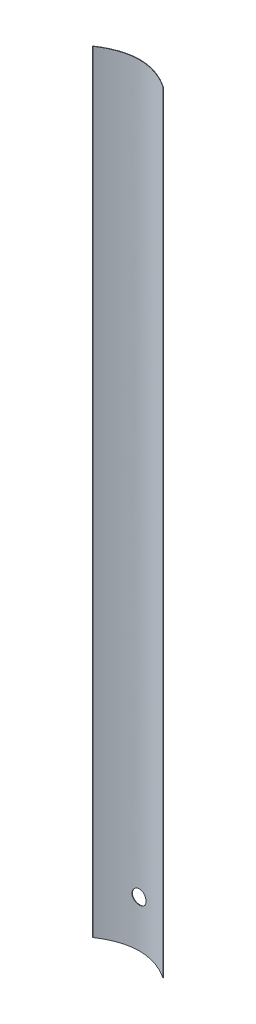
ISO-10303-21;
HEADER;
FILE_DESCRIPTION(('STEP AP214'),'2;1');
FILE_NAME('part.step','',(''),(''),'','','');
FILE_SCHEMA(('AUTOMOTIVE_DESIGN { 1 0 10303 214 1 1 1 1 }'));
ENDSEC;
DATA;
#1=APPLICATION_CONTEXT('core data for automotive mechanical design processes');
#2=APPLICATION_PROTOCOL_DEFINITION('international standard','automotive_design',2000,#1);
#3=PRODUCT_CONTEXT('',#1,'mechanical');
#4=PRODUCT('Part','Part','',(#3));
#5=PRODUCT_RELATED_PRODUCT_CATEGORY('part','',(#4));
#6=PRODUCT_DEFINITION_FORMATION('','',#4);
#7=PRODUCT_DEFINITION_CONTEXT('part definition',#1,'design');
#8=PRODUCT_DEFINITION('design','',#6,#7);
#9=PRODUCT_DEFINITION_SHAPE('','',#8);
#10=(LENGTH_UNIT() NAMED_UNIT(*) SI_UNIT(.MILLI.,.METRE.));
#11=(NAMED_UNIT(*) PLANE_ANGLE_UNIT() SI_UNIT($,.RADIAN.));
#12=(NAMED_UNIT(*) SI_UNIT($,.STERADIAN.) SOLID_ANGLE_UNIT());
#13=UNCERTAINTY_MEASURE_WITH_UNIT(LENGTH_MEASURE(1.E-05),#10,'distance_accuracy_value','');
#14=(GEOMETRIC_REPRESENTATION_CONTEXT(3) GLOBAL_UNCERTAINTY_ASSIGNED_CONTEXT((#13)) GLOBAL_UNIT_ASSIGNED_CONTEXT((#10,
#11,#12)) REPRESENTATION_CONTEXT('',''));
#15=CARTESIAN_POINT('',(0.,0.,0.));
#16=DIRECTION('',(0.,0.,1.));
#17=DIRECTION('',(1.,0.,0.));
#18=AXIS2_PLACEMENT_3D('',#15,#16,#17);
#19=CARTESIAN_POINT('',(7.55,165.1,2.55));
#20=CARTESIAN_POINT('',(0.,165.1,-2.55));
#21=CARTESIAN_POINT('',(-7.55,165.1,2.55));
#22=B_SPLINE_CURVE_WITH_KNOTS('',2,(#19,#20,#21),.UNSPECIFIED.,.F.,.F.,(3,3),(0.,1.),.UNSPECIFIED.);
#23=DIRECTION('',(0.,-1.,0.));
#24=VECTOR('',#23,1.);
#25=SURFACE_OF_LINEAR_EXTRUSION('',#22,#24);
#26=CARTESIAN_POINT('',(7.55,0.,2.55));
#27=CARTESIAN_POINT('',(0.,0.,-2.55));
#28=CARTESIAN_POINT('',(-7.55,0.,2.55));
#29=B_SPLINE_CURVE_WITH_KNOTS('',2,(#26,#27,#28),.UNSPECIFIED.,.F.,.F.,(3,3),(0.,1.),.UNSPECIFIED.);
#30=CARTESIAN_POINT('',(7.55,0.,2.55));
#31=VERTEX_POINT('',#30);
#32=CARTESIAN_POINT('',(-7.55,0.,2.55));
#33=VERTEX_POINT('',#32);
#34=EDGE_CURVE('E138',#31,#33,#29,.T.);
#35=ORIENTED_EDGE('',*,*,#34,.T.);
#36=DIRECTION('',(0.,-1.,0.));
#37=VECTOR('',#36,1.);
#38=CARTESIAN_POINT('',(-7.55,165.1,2.55));
#39=LINE('',#38,#37);
#40=CARTESIAN_POINT('',(-7.55,165.1,2.55));
#41=VERTEX_POINT('',#40);
#42=EDGE_CURVE('E11',#41,#33,#39,.T.);
#43=ORIENTED_EDGE('',*,*,#42,.F.);
#44=CARTESIAN_POINT('',(7.55,165.1,2.55));
#45=VERTEX_POINT('',#44);
#46=EDGE_CURVE('E99',#45,#41,#22,.T.);
#47=ORIENTED_EDGE('',*,*,#46,.F.);
#48=DIRECTION('',(0.,-1.,0.));
#49=VECTOR('',#48,1.);
#50=CARTESIAN_POINT('',(7.55,165.1,2.55));
#51=LINE('',#50,#49);
#52=EDGE_CURVE('E113',#45,#31,#51,.T.);
#53=ORIENTED_EDGE('',*,*,#52,.T.);
#54=EDGE_LOOP('',(#35,#43,#47,#53));
#55=FACE_BOUND('',#54,.T.);
#56=CARTESIAN_POINT('',(-1.5,10.,0.100653480110522));
#57=CARTESIAN_POINT('',(-1.49999431285718,10.0838646066992,0.100651792295512));
#58=CARTESIAN_POINT('',(-1.49293338316071,10.1678058005521,0.0996975639981939));
#59=CARTESIAN_POINT('',(-1.47193859508495,10.2918337185694,0.0969210509758727));
#60=CARTESIAN_POINT('',(-1.46319613678544,10.3328919671795,0.0957700049444247));
#61=CARTESIAN_POINT('',(-1.44230116384071,10.4141591924737,0.0930540127045029));
#62=CARTESIAN_POINT('',(-1.43014567901788,10.4543673964895,0.0914887060552477));
#63=CARTESIAN_POINT('',(-1.38872579838234,10.5731063897296,0.08623928605882));
#64=CARTESIAN_POINT('',(-1.35447729637129,10.6499314432978,0.0819973598487014));
#65=CARTESIAN_POINT('',(-1.27366670264574,10.7967402957515,0.0724976995606783));
#66=CARTESIAN_POINT('',(-1.22710371634554,10.8667235971118,0.0672398916915311));
#67=CARTESIAN_POINT('',(-1.14891722880494,10.9652814172152,0.0590199446646188));
#68=CARTESIAN_POINT('',(-1.1213562154828,10.9971622234563,0.0562142691923903));
#69=CARTESIAN_POINT('',(-1.0636836009766,11.058464445282,0.0505768141488451));
#70=CARTESIAN_POINT('',(-1.03357448605201,11.0878882038241,0.0477450623719434));
#71=CARTESIAN_POINT('',(-0.939660883994445,11.1722221739618,0.0393244827314267));
#72=CARTESIAN_POINT('',(-0.872251732421702,11.2232182370906,0.0338083132396485));
#73=CARTESIAN_POINT('',(-0.729552605881449,11.3133587939503,0.0235815519312012));
#74=CARTESIAN_POINT('',(-0.654233446146787,11.3524571646846,0.0188741252455889));
#75=CARTESIAN_POINT('',(-0.498015267740212,11.4174386640017,0.0108226125790484));
#76=CARTESIAN_POINT('',(-0.4171164883227,11.4433223588311,0.00747846818294234));
#77=CARTESIAN_POINT('',(-0.25255787469352,11.4809786661868,0.00255251178261552));
#78=CARTESIAN_POINT('',(-0.168917403810914,11.4928345864933,0.000960299447560821));
#79=CARTESIAN_POINT('',(-0.000819346726634837,11.5023598037955,-0.000315880879955819));
#80=CARTESIAN_POINT('',(0.0836382023600997,11.5000297421819,6.48540229111765E-08));
#81=CARTESIAN_POINT('',(0.250397215140917,11.4813156965399,0.00249568094463912));
#82=CARTESIAN_POINT('',(0.332709077696294,11.4650225332826,0.0046633070496314));
#83=CARTESIAN_POINT('',(0.493419855018071,11.4189869997377,0.0106022250034522));
#84=CARTESIAN_POINT('',(0.571818682946789,11.3892443311273,0.0143735524237988));
#85=CARTESIAN_POINT('',(0.72275755061085,11.3170580252888,0.0231126560570174));
#86=CARTESIAN_POINT('',(0.795278695384054,11.2745753417102,0.0280841011924957));
#87=CARTESIAN_POINT('',(0.932196985464237,11.1781431036395,0.0386641920627093));
#88=CARTESIAN_POINT('',(0.996593705047333,11.1241929486434,0.0442728711595746));
#89=CARTESIAN_POINT('',(1.11596568297943,11.0058524165738,0.0555509296080284));
#90=CARTESIAN_POINT('',(1.17086292806394,10.9413833287605,0.0612204396085769));
#91=CARTESIAN_POINT('',(1.2690697307717,10.8041047463486,0.0719390007951321));
#92=CARTESIAN_POINT('',(1.31237924946204,10.7312952237286,0.0769880498964584));
#93=CARTESIAN_POINT('',(1.38618506710864,10.5793346364595,0.0858972259978343));
#94=CARTESIAN_POINT('',(1.41667533332307,10.5001806068999,0.0897567929998749));
#95=CARTESIAN_POINT('',(1.46390914915503,10.3378128533396,0.0958430115563219));
#96=CARTESIAN_POINT('',(1.48065344861878,10.2545993510466,0.0980697521811431));
#97=CARTESIAN_POINT('',(1.49981680545721,10.0871571122116,0.100624757071384));
#98=CARTESIAN_POINT('',(1.50234457621831,10.0029410291904,0.100967428307808));
#99=CARTESIAN_POINT('',(1.49329052409646,9.83528645838535,0.0997541679389139));
#100=CARTESIAN_POINT('',(1.48170904539984,9.7518479516831,0.0981982826476949));
#101=CARTESIAN_POINT('',(1.44485629426366,9.5884434676593,0.0933740243452798));
#102=CARTESIAN_POINT('',(1.41963768567806,9.50846540174191,0.0901122407516485));
#103=CARTESIAN_POINT('',(1.35628123435544,9.35387289570522,0.0822451198699865));
#104=CARTESIAN_POINT('',(1.31814288536465,9.27925866590415,0.0776397299343732));
#105=CARTESIAN_POINT('',(1.22976671185468,9.13702515683216,0.0675661864530197));
#106=CARTESIAN_POINT('',(1.17945845465519,9.06944999760441,0.0620930770073404));
#107=CARTESIAN_POINT('',(1.06826960555367,8.94366335051936,0.0509135248451487));
#108=CARTESIAN_POINT('',(1.00738853669016,8.88545228532407,0.0452070716108969));
#109=CARTESIAN_POINT('',(0.876303853481724,8.77965943625974,0.0341592475910881));
#110=CARTESIAN_POINT('',(0.806041887715526,8.7321496389072,0.0288205077945384));
#111=CARTESIAN_POINT('',(0.65847167757806,8.64960667169101,0.0191531771295273));
#112=CARTESIAN_POINT('',(0.581163592612102,8.61457321966127,0.0148245634167305));
#113=CARTESIAN_POINT('',(0.421925924913392,8.55809385219361,0.0076812972517419));
#114=CARTESIAN_POINT('',(0.340010842989731,8.53660764588505,0.00486215927428902));
#115=CARTESIAN_POINT('',(0.173695875743016,8.50770201052955,0.00104048718657157));
#116=CARTESIAN_POINT('',(0.0892961220181454,8.50028183784539,3.78570420480021E-05));
#117=CARTESIAN_POINT('',(-0.078886813317133,8.49973614514404,-3.54433868341092E-05));
#118=CARTESIAN_POINT('',(-0.162669626042992,8.50649870844328,0.000878760481065696));
#119=CARTESIAN_POINT('',(-0.327886757549376,8.53388063435902,0.00450386476565588));
#120=CARTESIAN_POINT('',(-0.409321078293532,8.55449998538919,0.00721476368004195));
#121=CARTESIAN_POINT('',(-0.567554820884802,8.60900332200392,0.0141301827811963));
#122=CARTESIAN_POINT('',(-0.644356382605339,8.64288112850882,0.0183340071083666));
#123=CARTESIAN_POINT('',(-0.754407562727833,8.7028410554571,0.0253992468835352));
#124=CARTESIAN_POINT('',(-0.790239610339055,8.72435694021079,0.0278815001190132));
#125=CARTESIAN_POINT('',(-0.86001175884085,8.77031465432354,0.0330324110184899));
#126=CARTESIAN_POINT('',(-0.893950012257326,8.79475927008633,0.0357012451747152));
#127=CARTESIAN_POINT('',(-0.992968618144739,8.87257675409185,0.0439125539480101));
#128=CARTESIAN_POINT('',(-1.05478391747525,8.93017751012652,0.0496283201585527));
#129=CARTESIAN_POINT('',(-1.16788382971883,9.05494083439578,0.0608724682506412));
#130=CARTESIAN_POINT('',(-1.21916854692724,9.12210330791955,0.0664008519875784));
#131=CARTESIAN_POINT('',(-1.28721561200791,9.22872097494616,0.0740991601405075));
#132=CARTESIAN_POINT('',(-1.3084665396122,9.26535398220838,0.0765725158407119));
#133=CARTESIAN_POINT('',(-1.34778787538475,9.34025995872086,0.0812451514542522));
#134=CARTESIAN_POINT('',(-1.36586109294731,9.37853144179429,0.0834446729553131));
#135=CARTESIAN_POINT('',(-1.41510379001963,9.49541474988402,0.0895334562633409));
#136=CARTESIAN_POINT('',(-1.44136654006385,9.57620563882681,0.0929211905107007));
#137=CARTESIAN_POINT('',(-1.47369923859358,9.71448535437408,0.0971475067702848));
#138=CARTESIAN_POINT('',(-1.48354597342427,9.7711204485693,0.0984554075553561));
#139=CARTESIAN_POINT('',(-1.49669827226383,9.88515839112116,0.100208968338332));
#140=CARTESIAN_POINT('',(-1.50000389511722,9.94256123256641,0.100654636092975));
#141=CARTESIAN_POINT('',(-1.5,10.,0.100653480110522));
#142=B_SPLINE_CURVE_WITH_KNOTS('',3,(#56,#57,#58,#59,#60,#61,#62,#63,#64,#65,#66,#67,#68,#69,
#70,#71,#72,#73,#74,#75,#76,#77,#78,#79,#80,#81,#82,#83,#84,#85,#86,#87,#88,#89,#90,#91,#92,#93,
#94,#95,#96,#97,#98,#99,#100,#101,#102,#103,#104,#105,#106,#107,#108,#109,#110,#111,#112,#113,
#114,#115,#116,#117,#118,#119,#120,#121,#122,#123,#124,#125,#126,#127,#128,#129,#130,#131,#132,
#133,#134,#135,#136,#137,#138,#139,#140,#141),.UNSPECIFIED.,.T.,.F.,(4,2,2,2,2,2,2,2,2,2,2,2,2,
2,2,2,2,2,2,2,2,2,2,2,2,2,2,2,2,2,2,2,2,2,2,2,2,2,2,2,2,2,4),(0.,0.251349590871803,
0.377210195403726,0.503180671101366,0.75458108650983,1.00599976992016,1.1325762592091,
1.25903063734846,1.51185156364136,1.76564045187467,2.01941846438412,2.27168165867217,
2.52393344746866,2.77455685039652,3.02518581266382,3.27659090724563,3.52800917011144,
3.78140315101232,4.03479798326584,4.28831193004449,4.54181204664934,4.79337099177385,
5.04492380039797,5.29551202881263,5.54611007754173,5.79819468739714,6.05029067226768,
6.30403494960028,6.5577734878659,6.81075377771051,7.06372069272501,7.31469894648494,
7.56567699038999,7.81653820544647,7.94202050411351,8.0676231494658,8.32041322945643,
8.57320080568258,8.7003337405797,8.82735370658069,9.08100572243983,9.25315630113189,
9.42530533113218),.UNSPECIFIED.);
#143=CARTESIAN_POINT('',(-1.5,10.,0.100653480110522));
#144=VERTEX_POINT('',#143);
#145=EDGE_CURVE('E141',#144,#144,#142,.T.);
#146=ORIENTED_EDGE('',*,*,#145,.F.);
#147=EDGE_LOOP('',(#146));
#148=FACE_BOUND('',#147,.T.);
#149=ADVANCED_FACE('F39',(#55,#148),#25,.F.);
#150=CARTESIAN_POINT('',(-7.45,165.1,2.55));
#151=CARTESIAN_POINT('',(0.,165.1,-2.35));
#152=CARTESIAN_POINT('',(7.45,165.1,2.55));
#153=B_SPLINE_CURVE_WITH_KNOTS('',2,(#150,#151,#152),.UNSPECIFIED.,.F.,.F.,(3,3),(0.,1.),.UNSPECIFIED.);
#154=DIRECTION('',(0.,-1.,0.));
#155=VECTOR('',#154,1.);
#156=SURFACE_OF_LINEAR_EXTRUSION('',#153,#155);
#157=CARTESIAN_POINT('',(-7.45,0.,2.55));
#158=CARTESIAN_POINT('',(0.,0.,-2.35));
#159=CARTESIAN_POINT('',(7.45,0.,2.55));
#160=B_SPLINE_CURVE_WITH_KNOTS('',2,(#157,#158,#159),.UNSPECIFIED.,.F.,.F.,(3,3),(0.,1.),.UNSPECIFIED.);
#161=CARTESIAN_POINT('',(-7.45,0.,2.55));
#162=VERTEX_POINT('',#161);
#163=CARTESIAN_POINT('',(7.45,0.,2.55));
#164=VERTEX_POINT('',#163);
#165=EDGE_CURVE('E81',#162,#164,#160,.T.);
#166=ORIENTED_EDGE('',*,*,#165,.T.);
#167=DIRECTION('',(0.,-1.,0.));
#168=VECTOR('',#167,1.);
#169=CARTESIAN_POINT('',(7.45,165.1,2.55));
#170=LINE('',#169,#168);
#171=CARTESIAN_POINT('',(7.45,165.1,2.55));
#172=VERTEX_POINT('',#171);
#173=EDGE_CURVE('E106',#172,#164,#170,.T.);
#174=ORIENTED_EDGE('',*,*,#173,.F.);
#175=CARTESIAN_POINT('',(-7.45,165.1,2.55));
#176=VERTEX_POINT('',#175);
#177=EDGE_CURVE('E97',#176,#172,#153,.T.);
#178=ORIENTED_EDGE('',*,*,#177,.F.);
#179=DIRECTION('',(0.,-1.,0.));
#180=VECTOR('',#179,1.);
#181=CARTESIAN_POINT('',(-7.45,165.1,2.55));
#182=LINE('',#181,#180);
#183=EDGE_CURVE('E56',#176,#162,#182,.T.);
#184=ORIENTED_EDGE('',*,*,#183,.T.);
#185=EDGE_LOOP('',(#166,#174,#178,#184));
#186=FACE_BOUND('',#185,.T.);
#187=CARTESIAN_POINT('',(-1.5,10.,0.199319850457186));
#188=CARTESIAN_POINT('',(-1.49999430848386,9.91612492163028,0.199318182227655));
#189=CARTESIAN_POINT('',(-1.49293162183111,9.83217296057274,0.198376362523933));
#190=CARTESIAN_POINT('',(-1.47193131908059,9.70812874572493,0.195635928665539));
#191=CARTESIAN_POINT('',(-1.46318650797823,9.66706494479353,0.194499833439166));
#192=CARTESIAN_POINT('',(-1.44228577972542,9.58578661984074,0.191819112214607));
#193=CARTESIAN_POINT('',(-1.43012689060928,9.5455728687333,0.190274130346939));
#194=CARTESIAN_POINT('',(-1.38869498973417,9.42681700663659,0.185092842792504));
#195=CARTESIAN_POINT('',(-1.35443613249865,9.34998082134359,0.180905948855757));
#196=CARTESIAN_POINT('',(-1.27360014927512,9.20315176876102,0.171529597235092));
#197=CARTESIAN_POINT('',(-1.22702214527932,9.13315938972905,0.166340068098665));
#198=CARTESIAN_POINT('',(-1.14881402064101,9.03459565960986,0.158227468412158));
#199=CARTESIAN_POINT('',(-1.12124817493762,9.00271620147691,0.155458738766124));
#200=CARTESIAN_POINT('',(-1.06356585942425,8.94141715985287,0.149895617312838));
#201=CARTESIAN_POINT('',(-1.03345187566475,8.9119952331648,0.147101252836312));
#202=CARTESIAN_POINT('',(-0.939523860548354,8.82766770109499,0.138792026417468));
#203=CARTESIAN_POINT('',(-0.872105321432624,8.77667714547239,0.133349037082873));
#204=CARTESIAN_POINT('',(-0.729396746150069,8.68655497139147,0.12325905828651));
#205=CARTESIAN_POINT('',(-0.654078320898569,8.64746824036854,0.118615109816103));
#206=CARTESIAN_POINT('',(-0.497865558488165,8.58250914254702,0.110672652109048));
#207=CARTESIAN_POINT('',(-0.416971454309424,8.55663622398773,0.107374086695262));
#208=CARTESIAN_POINT('',(-0.25241279356707,8.51899633098805,0.10251541176302));
#209=CARTESIAN_POINT('',(-0.16876708393661,8.50714820021797,0.100945304029303));
#210=CARTESIAN_POINT('',(-0.000660304636181675,8.49763989407351,0.0996882603813845));
#211=CARTESIAN_POINT('',(0.0838007289306916,8.49997909332578,0.100001241461174));
#212=CARTESIAN_POINT('',(0.250580012756493,8.51871418145095,0.102466531176089));
#213=CARTESIAN_POINT('',(0.332908394334284,8.53502162850044,0.104607266865084));
#214=CARTESIAN_POINT('',(0.493649835440898,8.58109184585235,0.11047166057192));
#215=CARTESIAN_POINT('',(0.572062810071875,8.61085490777257,0.1141953528964));
#216=CARTESIAN_POINT('',(0.72302026890586,8.68308524735493,0.122823143734849));
#217=CARTESIAN_POINT('',(0.795546316765941,8.72559061702758,0.127730772811627));
#218=CARTESIAN_POINT('',(0.932469595415847,8.82207151731782,0.138174326273406));
#219=CARTESIAN_POINT('',(0.99686641127381,8.87604763304765,0.143710282702095));
#220=CARTESIAN_POINT('',(1.11621982931086,8.99442966367382,0.154840018407951));
#221=CARTESIAN_POINT('',(1.17110042218408,9.0589122289115,0.160433915992556));
#222=CARTESIAN_POINT('',(1.26927146334274,9.19621383285374,0.171008510815199));
#223=CARTESIAN_POINT('',(1.31256187451126,9.26903289825441,0.175989206089462));
#224=CARTESIAN_POINT('',(1.38632713462777,9.42100598883487,0.184776566618406));
#225=CARTESIAN_POINT('',(1.41679620122249,9.5001628532118,0.188582701947364));
#226=CARTESIAN_POINT('',(1.46398812186988,9.66253094000489,0.194583370253541));
#227=CARTESIAN_POINT('',(1.48071170572754,9.7457419469212,0.196777988792245));
#228=CARTESIAN_POINT('',(1.49983758193486,9.91319158130336,0.199294273517368));
#229=CARTESIAN_POINT('',(1.50234577630529,9.99741791255856,0.199629789255558));
#230=CARTESIAN_POINT('',(1.49324953676709,10.1650896882237,0.198427042408363));
#231=CARTESIAN_POINT('',(1.48164543789711,10.2485351511248,0.196888824307118));
#232=CARTESIAN_POINT('',(1.44474267411651,10.4119591419536,0.192122310316789));
#233=CARTESIAN_POINT('',(1.41949522398304,10.4919494349244,0.188900336435752));
#234=CARTESIAN_POINT('',(1.35607558656885,10.6465612921507,0.181130685808157));
#235=CARTESIAN_POINT('',(1.3179029049684,10.7211826509413,0.176582958359669));
#236=CARTESIAN_POINT('',(1.22945986851615,10.8634129233087,0.16663752665366));
#237=CARTESIAN_POINT('',(1.17912082699192,10.9309787866973,0.161235058903362));
#238=CARTESIAN_POINT('',(1.06787073729423,11.0567407383057,0.150201175154445));
#239=CARTESIAN_POINT('',(1.00695922503413,11.1149364149978,0.14456974911384));
#240=CARTESIAN_POINT('',(0.875827519012701,11.2206822084744,0.133669702745092));
#241=CARTESIAN_POINT('',(0.805550572732966,11.2681622479607,0.128403618319682));
#242=CARTESIAN_POINT('',(0.657957326228358,11.3506437069924,0.118869438307118));
#243=CARTESIAN_POINT('',(0.580641181758157,11.3856454025589,0.114601320645642));
#244=CARTESIAN_POINT('',(0.421389494861218,11.4420629605658,0.107559484740667));
#245=CARTESIAN_POINT('',(0.339468105509957,11.4635182089356,0.104781437734228));
#246=CARTESIAN_POINT('',(0.173146971523947,11.4923616571668,0.101018272461007));
#247=CARTESIAN_POINT('',(0.0887473544968752,11.4997505800393,0.100033062042301));
#248=CARTESIAN_POINT('',(-0.079447543441947,11.5002350776779,0.0999688374988829));
#249=CARTESIAN_POINT('',(-0.163242505171073,11.4934396276245,0.100875290162887));
#250=CARTESIAN_POINT('',(-0.328478615014005,11.465987739276,0.104461268247837));
#251=CARTESIAN_POINT('',(-0.409919764782943,11.4453313107278,0.107140792421979));
#252=CARTESIAN_POINT('',(-0.568163274525011,11.3907493611203,0.113973425389567));
#253=CARTESIAN_POINT('',(-0.644967664472495,11.3568296960587,0.118125883776561));
#254=CARTESIAN_POINT('',(-0.755017374773707,11.2968044190081,0.125103346876349));
#255=CARTESIAN_POINT('',(-0.790847961867643,11.2752663328801,0.127554544257236));
#256=CARTESIAN_POINT('',(-0.860615102892328,11.2292635125098,0.132640574222239));
#257=CARTESIAN_POINT('',(-0.894549807094597,11.2047959908351,0.135275580694477));
#258=CARTESIAN_POINT('',(-0.993541368023898,11.1269189071285,0.143381078690621));
#259=CARTESIAN_POINT('',(-1.05533132469138,11.0692829203666,0.149021890119534));
#260=CARTESIAN_POINT('',(-1.16837408133184,10.944453474304,0.160116625183689));
#261=CARTESIAN_POINT('',(-1.21962698953563,10.8772601131836,0.165570550738043));
#262=CARTESIAN_POINT('',(-1.28761913732596,10.7706050317865,0.173163272769945));
#263=CARTESIAN_POINT('',(-1.30884954421367,10.7339632708604,0.175602238206294));
#264=CARTESIAN_POINT('',(-1.34812924723165,10.659042005775,0.180209337086597));
#265=CARTESIAN_POINT('',(-1.36618135276379,10.6207639855386,0.182377709217753));
#266=CARTESIAN_POINT('',(-1.41536006953214,10.5038647863048,0.18837930651003));
#267=CARTESIAN_POINT('',(-1.44157939724707,10.4230679931154,0.191717169928524));
#268=CARTESIAN_POINT('',(-1.47381308396563,10.2849014058217,0.195875208098829));
#269=CARTESIAN_POINT('',(-1.48361725642184,10.2283857558303,0.197160254635351));
#270=CARTESIAN_POINT('',(-1.49671263080528,10.1145920325207,0.198883142116427));
#271=CARTESIAN_POINT('',(-1.50000388915716,10.057313965812,0.199320990400685));
#272=CARTESIAN_POINT('',(-1.5,10.,0.199319850457186));
#273=B_SPLINE_CURVE_WITH_KNOTS('',3,(#187,#188,#189,#190,#191,#192,#193,#194,#195,#196,#197,
#198,#199,#200,#201,#202,#203,#204,#205,#206,#207,#208,#209,#210,#211,#212,#213,#214,#215,#216,
#217,#218,#219,#220,#221,#222,#223,#224,#225,#226,#227,#228,#229,#230,#231,#232,#233,#234,#235,
#236,#237,#238,#239,#240,#241,#242,#243,#244,#245,#246,#247,#248,#249,#250,#251,#252,#253,#254,
#255,#256,#257,#258,#259,#260,#261,#262,#263,#264,#265,#266,#267,#268,#269,#270,#271,#272),
.UNSPECIFIED.,.T.,.F.,(4,2,2,2,2,2,2,2,2,2,2,2,2,2,2,2,2,2,2,2,2,2,2,2,2,2,2,2,2,2,2,2,2,2,2,2,
2,2,2,2,2,2,4),(0.,0.251381497447422,0.377258655139043,0.503245730826643,0.754680603653717,
1.00613340152849,1.13270896176223,1.25916242382021,1.5119813598337,1.76574215728378,
2.01949235774053,2.27176690635246,2.52403033485678,2.77470823169601,3.02539156163083,
3.27683188977099,3.52828504673128,3.78166237528024,4.0350405152464,4.28853280515294,
4.54201163522743,4.79359958743875,5.04518156684037,5.29582564567678,5.54647931136718,
5.79858255968444,6.05069687706551,6.30441503000739,6.55812757035148,6.81109900965769,
7.06405744584714,7.31507961749475,7.56610161262671,7.81701290118805,7.94252011348245,
8.0681477126411,8.3209388474895,8.57372738567531,8.70084624466444,8.82785216886211,
9.08147529910452,9.2532521326175,9.42502747793477),.UNSPECIFIED.);
#274=CARTESIAN_POINT('',(-1.5,10.,0.199319850457186));
#275=VERTEX_POINT('',#274);
#276=EDGE_CURVE('E44',#275,#275,#273,.T.);
#277=ORIENTED_EDGE('',*,*,#276,.F.);
#278=EDGE_LOOP('',(#277));
#279=FACE_BOUND('',#278,.T.);
#280=ADVANCED_FACE('F108',(#186,#279),#156,.F.);
#281=CARTESIAN_POINT('',(-7.45,165.1,2.55));
#282=DIRECTION('',(0.,0.,-1.));
#283=DIRECTION('',(-1.,0.,0.));
#284=AXIS2_PLACEMENT_3D('',#281,#282,#283);
#285=PLANE('',#284);
#286=DIRECTION('',(1.,0.,0.));
#287=VECTOR('',#286,1.);
#288=CARTESIAN_POINT('',(-7.45,0.,2.55));
#289=LINE('',#288,#287);
#290=EDGE_CURVE('E104',#33,#162,#289,.T.);
#291=ORIENTED_EDGE('',*,*,#290,.T.);
#292=ORIENTED_EDGE('',*,*,#183,.F.);
#293=DIRECTION('',(1.,0.,0.));
#294=VECTOR('',#293,1.);
#295=CARTESIAN_POINT('',(-7.45,165.1,2.55));
#296=LINE('',#295,#294);
#297=EDGE_CURVE('E94',#41,#176,#296,.T.);
#298=ORIENTED_EDGE('',*,*,#297,.F.);
#299=ORIENTED_EDGE('',*,*,#42,.T.);
#300=EDGE_LOOP('',(#291,#292,#298,#299));
#301=FACE_BOUND('',#300,.T.);
#302=ADVANCED_FACE('F103',(#301),#285,.F.);
#303=CARTESIAN_POINT('',(7.55,165.1,2.55));
#304=DIRECTION('',(0.,0.,-1.));
#305=DIRECTION('',(-1.,0.,0.));
#306=AXIS2_PLACEMENT_3D('',#303,#304,#305);
#307=PLANE('',#306);
#308=DIRECTION('',(1.,0.,0.));
#309=VECTOR('',#308,1.);
#310=CARTESIAN_POINT('',(7.55,0.,2.55));
#311=LINE('',#310,#309);
#312=EDGE_CURVE('E87',#164,#31,#311,.T.);
#313=ORIENTED_EDGE('',*,*,#312,.T.);
#314=ORIENTED_EDGE('',*,*,#52,.F.);
#315=DIRECTION('',(1.,0.,0.));
#316=VECTOR('',#315,1.);
#317=CARTESIAN_POINT('',(7.55,165.1,2.55));
#318=LINE('',#317,#316);
#319=EDGE_CURVE('E64',#172,#45,#318,.T.);
#320=ORIENTED_EDGE('',*,*,#319,.F.);
#321=ORIENTED_EDGE('',*,*,#173,.T.);
#322=EDGE_LOOP('',(#313,#314,#320,#321));
#323=FACE_BOUND('',#322,.T.);
#324=ADVANCED_FACE('F125',(#323),#307,.F.);
#325=CARTESIAN_POINT('',(0.,165.1,0.));
#326=DIRECTION('',(0.,-1.,0.));
#327=DIRECTION('',(0.,0.,-1.));
#328=AXIS2_PLACEMENT_3D('',#325,#326,#327);
#329=PLANE('',#328);
#330=ORIENTED_EDGE('',*,*,#46,.T.);
#331=ORIENTED_EDGE('',*,*,#297,.T.);
#332=ORIENTED_EDGE('',*,*,#177,.T.);
#333=ORIENTED_EDGE('',*,*,#319,.T.);
#334=EDGE_LOOP('',(#330,#331,#332,#333));
#335=FACE_BOUND('',#334,.T.);
#336=ADVANCED_FACE('F95',(#335),#329,.F.);
#337=CARTESIAN_POINT('',(0.,0.,0.));
#338=DIRECTION('',(0.,-1.,0.));
#339=DIRECTION('',(0.,0.,-1.));
#340=AXIS2_PLACEMENT_3D('',#337,#338,#339);
#341=PLANE('',#340);
#342=ORIENTED_EDGE('',*,*,#34,.F.);
#343=ORIENTED_EDGE('',*,*,#312,.F.);
#344=ORIENTED_EDGE('',*,*,#165,.F.);
#345=ORIENTED_EDGE('',*,*,#290,.F.);
#346=EDGE_LOOP('',(#342,#343,#344,#345));
#347=FACE_BOUND('',#346,.T.);
#348=ADVANCED_FACE('F158',(#347),#341,.T.);
#349=CARTESIAN_POINT('',(0.,10.,2.55));
#350=DIRECTION('',(0.,0.,-1.));
#351=DIRECTION('',(-1.,0.,0.));
#352=AXIS2_PLACEMENT_3D('',#349,#350,#351);
#353=CYLINDRICAL_SURFACE('',#352,1.5);
#354=ORIENTED_EDGE('',*,*,#276,.T.);
#355=EDGE_LOOP('',(#354));
#356=FACE_BOUND('',#355,.T.);
#357=ORIENTED_EDGE('',*,*,#145,.T.);
#358=EDGE_LOOP('',(#357));
#359=FACE_BOUND('',#358,.T.);
#360=ADVANCED_FACE('F154',(#356,#359),#353,.F.);
#361=CLOSED_SHELL('',(#149,#280,#302,#324,#336,#348,#360));
#362=MANIFOLD_SOLID_BREP('B2',#361);
#363=ADVANCED_BREP_SHAPE_REPRESENTATION('',(#18,#362),#14);
#364=SHAPE_DEFINITION_REPRESENTATION(#9,#363);
ENDSEC;
END-ISO-10303-21;
